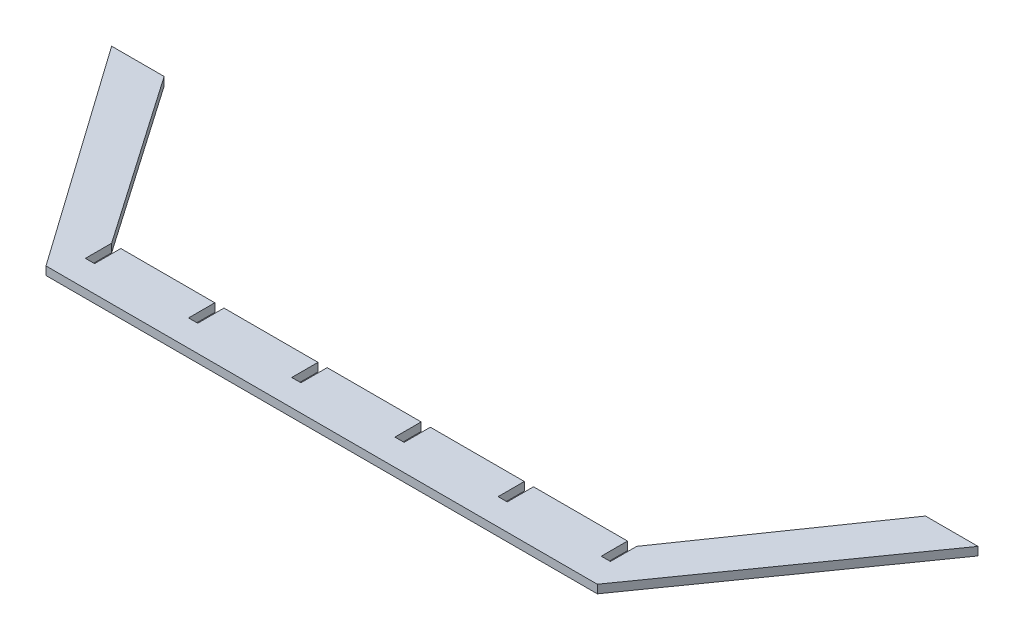
ISO-10303-21;
HEADER;
FILE_DESCRIPTION(('STEP AP214'),'2;1');
FILE_NAME('part.step','',(''),(''),'','','');
FILE_SCHEMA(('AUTOMOTIVE_DESIGN { 1 0 10303 214 1 1 1 1 }'));
ENDSEC;
DATA;
#1=APPLICATION_CONTEXT('core data for automotive mechanical design processes');
#2=APPLICATION_PROTOCOL_DEFINITION('international standard','automotive_design',2000,#1);
#3=PRODUCT_CONTEXT('',#1,'mechanical');
#4=PRODUCT('Part','Part','',(#3));
#5=PRODUCT_RELATED_PRODUCT_CATEGORY('part','',(#4));
#6=PRODUCT_DEFINITION_FORMATION('','',#4);
#7=PRODUCT_DEFINITION_CONTEXT('part definition',#1,'design');
#8=PRODUCT_DEFINITION('design','',#6,#7);
#9=PRODUCT_DEFINITION_SHAPE('','',#8);
#10=(LENGTH_UNIT() NAMED_UNIT(*) SI_UNIT(.MILLI.,.METRE.));
#11=(NAMED_UNIT(*) PLANE_ANGLE_UNIT() SI_UNIT($,.RADIAN.));
#12=(NAMED_UNIT(*) SI_UNIT($,.STERADIAN.) SOLID_ANGLE_UNIT());
#13=UNCERTAINTY_MEASURE_WITH_UNIT(LENGTH_MEASURE(1.E-05),#10,'distance_accuracy_value','');
#14=(GEOMETRIC_REPRESENTATION_CONTEXT(3) GLOBAL_UNCERTAINTY_ASSIGNED_CONTEXT((#13)) GLOBAL_UNIT_ASSIGNED_CONTEXT((#10,
#11,#12)) REPRESENTATION_CONTEXT('',''));
#15=CARTESIAN_POINT('',(0.,0.,0.));
#16=DIRECTION('',(0.,0.,1.));
#17=DIRECTION('',(1.,0.,0.));
#18=AXIS2_PLACEMENT_3D('',#15,#16,#17);
#19=CARTESIAN_POINT('',(0.,3.175,-20.));
#20=DIRECTION('',(0.,0.,1.));
#21=DIRECTION('',(1.,0.,0.));
#22=AXIS2_PLACEMENT_3D('',#19,#20,#21);
#23=PLANE('',#22);
#24=DIRECTION('',(-1.,0.,0.));
#25=VECTOR('',#24,1.);
#26=CARTESIAN_POINT('',(0.,0.,-20.));
#27=LINE('',#26,#25);
#28=CARTESIAN_POINT('',(78.6,0.,-20.));
#29=VERTEX_POINT('',#28);
#30=CARTESIAN_POINT('',(42.8,0.,-20.));
#31=VERTEX_POINT('',#30);
#32=EDGE_CURVE('E420',#29,#31,#27,.T.);
#33=ORIENTED_EDGE('',*,*,#32,.T.);
#34=DIRECTION('',(0.,1.,0.));
#35=VECTOR('',#34,1.);
#36=CARTESIAN_POINT('',(42.8,0.,-20.));
#37=LINE('',#36,#35);
#38=CARTESIAN_POINT('',(42.8,3.175,-20.));
#39=VERTEX_POINT('',#38);
#40=EDGE_CURVE('E257',#31,#39,#37,.T.);
#41=ORIENTED_EDGE('',*,*,#40,.T.);
#42=DIRECTION('',(-1.,0.,0.));
#43=VECTOR('',#42,1.);
#44=CARTESIAN_POINT('',(0.,3.175,-20.));
#45=LINE('',#44,#43);
#46=CARTESIAN_POINT('',(78.6,3.175,-20.));
#47=VERTEX_POINT('',#46);
#48=EDGE_CURVE('E401',#47,#39,#45,.T.);
#49=ORIENTED_EDGE('',*,*,#48,.F.);
#50=DIRECTION('',(0.,1.,0.));
#51=VECTOR('',#50,1.);
#52=CARTESIAN_POINT('',(78.6,0.,-20.));
#53=LINE('',#52,#51);
#54=EDGE_CURVE('E298',#29,#47,#53,.T.);
#55=ORIENTED_EDGE('',*,*,#54,.F.);
#56=EDGE_LOOP('',(#33,#41,#49,#55));
#57=FACE_BOUND('',#56,.T.);
#58=ADVANCED_FACE('F32',(#57),#23,.F.);
#59=CARTESIAN_POINT('',(117.9,0.,-20.));
#60=VERTEX_POINT('',#59);
#61=CARTESIAN_POINT('',(82.1,0.,-20.));
#62=VERTEX_POINT('',#61);
#63=EDGE_CURVE('E502',#60,#62,#27,.T.);
#64=ORIENTED_EDGE('',*,*,#63,.T.);
#65=DIRECTION('',(0.,1.,0.));
#66=VECTOR('',#65,1.);
#67=CARTESIAN_POINT('',(82.1,0.,-20.));
#68=LINE('',#67,#66);
#69=CARTESIAN_POINT('',(82.1,3.175,-20.));
#70=VERTEX_POINT('',#69);
#71=EDGE_CURVE('E277',#62,#70,#68,.T.);
#72=ORIENTED_EDGE('',*,*,#71,.T.);
#73=CARTESIAN_POINT('',(117.9,3.175,-20.));
#74=VERTEX_POINT('',#73);
#75=EDGE_CURVE('E528',#74,#70,#45,.T.);
#76=ORIENTED_EDGE('',*,*,#75,.F.);
#77=DIRECTION('',(0.,1.,0.));
#78=VECTOR('',#77,1.);
#79=CARTESIAN_POINT('',(117.9,0.,-20.));
#80=LINE('',#79,#78);
#81=EDGE_CURVE('E324',#60,#74,#80,.T.);
#82=ORIENTED_EDGE('',*,*,#81,.F.);
#83=EDGE_LOOP('',(#64,#72,#76,#82));
#84=FACE_BOUND('',#83,.T.);
#85=ADVANCED_FACE('F537',(#84),#23,.F.);
#86=CARTESIAN_POINT('',(157.2,0.,-20.));
#87=VERTEX_POINT('',#86);
#88=CARTESIAN_POINT('',(121.4,0.,-20.));
#89=VERTEX_POINT('',#88);
#90=EDGE_CURVE('E504',#87,#89,#27,.T.);
#91=ORIENTED_EDGE('',*,*,#90,.T.);
#92=DIRECTION('',(0.,1.,0.));
#93=VECTOR('',#92,1.);
#94=CARTESIAN_POINT('',(121.4,0.,-20.));
#95=LINE('',#94,#93);
#96=CARTESIAN_POINT('',(121.4,3.175,-20.));
#97=VERTEX_POINT('',#96);
#98=EDGE_CURVE('E303',#89,#97,#95,.T.);
#99=ORIENTED_EDGE('',*,*,#98,.T.);
#100=CARTESIAN_POINT('',(157.2,3.175,-20.));
#101=VERTEX_POINT('',#100);
#102=EDGE_CURVE('E526',#101,#97,#45,.T.);
#103=ORIENTED_EDGE('',*,*,#102,.F.);
#104=DIRECTION('',(0.,1.,0.));
#105=VECTOR('',#104,1.);
#106=CARTESIAN_POINT('',(157.2,0.,-20.));
#107=LINE('',#106,#105);
#108=EDGE_CURVE('E350',#87,#101,#107,.T.);
#109=ORIENTED_EDGE('',*,*,#108,.F.);
#110=EDGE_LOOP('',(#91,#99,#103,#109));
#111=FACE_BOUND('',#110,.T.);
#112=ADVANCED_FACE('F560',(#111),#23,.F.);
#113=CARTESIAN_POINT('',(196.5,0.,-20.));
#114=VERTEX_POINT('',#113);
#115=CARTESIAN_POINT('',(160.7,0.,-20.));
#116=VERTEX_POINT('',#115);
#117=EDGE_CURVE('E421',#114,#116,#27,.T.);
#118=ORIENTED_EDGE('',*,*,#117,.T.);
#119=DIRECTION('',(0.,1.,0.));
#120=VECTOR('',#119,1.);
#121=CARTESIAN_POINT('',(160.7,0.,-20.));
#122=LINE('',#121,#120);
#123=CARTESIAN_POINT('',(160.7,3.175,-20.));
#124=VERTEX_POINT('',#123);
#125=EDGE_CURVE('E329',#116,#124,#122,.T.);
#126=ORIENTED_EDGE('',*,*,#125,.T.);
#127=CARTESIAN_POINT('',(196.5,3.175,-20.));
#128=VERTEX_POINT('',#127);
#129=EDGE_CURVE('E402',#128,#124,#45,.T.);
#130=ORIENTED_EDGE('',*,*,#129,.F.);
#131=DIRECTION('',(0.,1.,0.));
#132=VECTOR('',#131,1.);
#133=CARTESIAN_POINT('',(196.5,0.,-20.));
#134=LINE('',#133,#132);
#135=EDGE_CURVE('E376',#114,#128,#134,.T.);
#136=ORIENTED_EDGE('',*,*,#135,.F.);
#137=EDGE_LOOP('',(#118,#126,#130,#136));
#138=FACE_BOUND('',#137,.T.);
#139=ADVANCED_FACE('F516',(#138),#23,.F.);
#140=CARTESIAN_POINT('',(205.,3.175,0.));
#141=DIRECTION('',(-0.816967863264762,0.,-0.576683197598655));
#142=DIRECTION('',(-0.576683197598655,0.,0.816967863264762));
#143=AXIS2_PLACEMENT_3D('',#140,#141,#142);
#144=PLANE('',#143);
#145=DIRECTION('',(0.576683197598655,0.,-0.816967863264762));
#146=VECTOR('',#145,1.);
#147=CARTESIAN_POINT('',(205.,0.,0.));
#148=LINE('',#147,#146);
#149=CARTESIAN_POINT('',(205.,0.,0.));
#150=VERTEX_POINT('',#149);
#151=CARTESIAN_POINT('',(265.,0.,-85.));
#152=VERTEX_POINT('',#151);
#153=EDGE_CURVE('E262',#150,#152,#148,.T.);
#154=ORIENTED_EDGE('',*,*,#153,.T.);
#155=DIRECTION('',(0.,-1.,0.));
#156=VECTOR('',#155,1.);
#157=CARTESIAN_POINT('',(265.,3.175,-85.));
#158=LINE('',#157,#156);
#159=CARTESIAN_POINT('',(265.,3.175,-85.));
#160=VERTEX_POINT('',#159);
#161=EDGE_CURVE('E40',#160,#152,#158,.T.);
#162=ORIENTED_EDGE('',*,*,#161,.F.);
#163=DIRECTION('',(0.576683197598655,0.,-0.816967863264762));
#164=VECTOR('',#163,1.);
#165=CARTESIAN_POINT('',(205.,3.175,0.));
#166=LINE('',#165,#164);
#167=CARTESIAN_POINT('',(205.,3.175,0.));
#168=VERTEX_POINT('',#167);
#169=EDGE_CURVE('E390',#168,#160,#166,.T.);
#170=ORIENTED_EDGE('',*,*,#169,.F.);
#171=DIRECTION('',(0.,-1.,0.));
#172=VECTOR('',#171,1.);
#173=CARTESIAN_POINT('',(205.,3.175,0.));
#174=LINE('',#173,#172);
#175=EDGE_CURVE('E11',#168,#150,#174,.T.);
#176=ORIENTED_EDGE('',*,*,#175,.T.);
#177=EDGE_LOOP('',(#154,#162,#170,#176));
#178=FACE_BOUND('',#177,.T.);
#179=ADVANCED_FACE('F34',(#178),#144,.F.);
#180=CARTESIAN_POINT('',(245.,3.175,-85.));
#181=DIRECTION('',(0.,0.,1.));
#182=DIRECTION('',(1.,0.,0.));
#183=AXIS2_PLACEMENT_3D('',#180,#181,#182);
#184=PLANE('',#183);
#185=DIRECTION('',(-1.,0.,0.));
#186=VECTOR('',#185,1.);
#187=CARTESIAN_POINT('',(245.,0.,-85.));
#188=LINE('',#187,#186);
#189=CARTESIAN_POINT('',(245.,0.,-85.));
#190=VERTEX_POINT('',#189);
#191=EDGE_CURVE('E412',#152,#190,#188,.T.);
#192=ORIENTED_EDGE('',*,*,#191,.T.);
#193=DIRECTION('',(0.,-1.,0.));
#194=VECTOR('',#193,1.);
#195=CARTESIAN_POINT('',(245.,3.175,-85.));
#196=LINE('',#195,#194);
#197=CARTESIAN_POINT('',(245.,3.175,-85.));
#198=VERTEX_POINT('',#197);
#199=EDGE_CURVE('E440',#198,#190,#196,.T.);
#200=ORIENTED_EDGE('',*,*,#199,.F.);
#201=DIRECTION('',(-1.,0.,0.));
#202=VECTOR('',#201,1.);
#203=CARTESIAN_POINT('',(245.,3.175,-85.));
#204=LINE('',#203,#202);
#205=EDGE_CURVE('E393',#160,#198,#204,.T.);
#206=ORIENTED_EDGE('',*,*,#205,.F.);
#207=ORIENTED_EDGE('',*,*,#161,.T.);
#208=EDGE_LOOP('',(#192,#200,#206,#207));
#209=FACE_BOUND('',#208,.T.);
#210=ADVANCED_FACE('F447',(#209),#184,.F.);
#211=CARTESIAN_POINT('',(200.,3.175,-20.));
#212=DIRECTION('',(0.822192191643778,0.,0.569209978830308));
#213=DIRECTION('',(0.569209978830309,0.,-0.822192191643779));
#214=AXIS2_PLACEMENT_3D('',#211,#212,#213);
#215=PLANE('',#214);
#216=DIRECTION('',(-0.569209978830308,0.,0.822192191643778));
#217=VECTOR('',#216,1.);
#218=CARTESIAN_POINT('',(200.,0.,-20.));
#219=LINE('',#218,#217);
#220=CARTESIAN_POINT('',(200.,0.,-20.));
#221=VERTEX_POINT('',#220);
#222=EDGE_CURVE('E414',#190,#221,#219,.T.);
#223=ORIENTED_EDGE('',*,*,#222,.T.);
#224=DIRECTION('',(0.,-1.,0.));
#225=VECTOR('',#224,1.);
#226=CARTESIAN_POINT('',(200.,3.175,-20.));
#227=LINE('',#226,#225);
#228=CARTESIAN_POINT('',(200.,3.175,-20.));
#229=VERTEX_POINT('',#228);
#230=EDGE_CURVE('E438',#229,#221,#227,.T.);
#231=ORIENTED_EDGE('',*,*,#230,.F.);
#232=DIRECTION('',(-0.569209978830308,0.,0.822192191643778));
#233=VECTOR('',#232,1.);
#234=CARTESIAN_POINT('',(200.,3.175,-20.));
#235=LINE('',#234,#233);
#236=EDGE_CURVE('E395',#198,#229,#235,.T.);
#237=ORIENTED_EDGE('',*,*,#236,.F.);
#238=ORIENTED_EDGE('',*,*,#199,.T.);
#239=EDGE_LOOP('',(#223,#231,#237,#238));
#240=FACE_BOUND('',#239,.T.);
#241=ADVANCED_FACE('F457',(#240),#215,.F.);
#242=CARTESIAN_POINT('',(39.3,0.,-20.));
#243=VERTEX_POINT('',#242);
#244=CARTESIAN_POINT('',(3.5,0.,-20.));
#245=VERTEX_POINT('',#244);
#246=EDGE_CURVE('E417',#243,#245,#27,.T.);
#247=ORIENTED_EDGE('',*,*,#246,.T.);
#248=DIRECTION('',(0.,1.,0.));
#249=VECTOR('',#248,1.);
#250=CARTESIAN_POINT('',(3.5,0.,-20.));
#251=LINE('',#250,#249);
#252=CARTESIAN_POINT('',(3.5,3.175,-20.));
#253=VERTEX_POINT('',#252);
#254=EDGE_CURVE('E259',#245,#253,#251,.T.);
#255=ORIENTED_EDGE('',*,*,#254,.T.);
#256=CARTESIAN_POINT('',(39.3,3.175,-20.));
#257=VERTEX_POINT('',#256);
#258=EDGE_CURVE('E398',#257,#253,#45,.T.);
#259=ORIENTED_EDGE('',*,*,#258,.F.);
#260=DIRECTION('',(0.,1.,0.));
#261=VECTOR('',#260,1.);
#262=CARTESIAN_POINT('',(39.3,0.,-20.));
#263=LINE('',#262,#261);
#264=EDGE_CURVE('E272',#243,#257,#263,.T.);
#265=ORIENTED_EDGE('',*,*,#264,.F.);
#266=EDGE_LOOP('',(#247,#255,#259,#265));
#267=FACE_BOUND('',#266,.T.);
#268=ADVANCED_FACE('F484',(#267),#23,.F.);
#269=CARTESIAN_POINT('',(-45.,3.175,-85.));
#270=DIRECTION('',(-0.822192191643779,0.,0.569209978830308));
#271=DIRECTION('',(0.569209978830308,0.,0.822192191643779));
#272=AXIS2_PLACEMENT_3D('',#269,#270,#271);
#273=PLANE('',#272);
#274=DIRECTION('',(-0.569209978830308,0.,-0.822192191643779));
#275=VECTOR('',#274,1.);
#276=CARTESIAN_POINT('',(-45.,0.,-85.));
#277=LINE('',#276,#275);
#278=CARTESIAN_POINT('',(0.,0.,-20.));
#279=VERTEX_POINT('',#278);
#280=CARTESIAN_POINT('',(-45.,0.,-85.));
#281=VERTEX_POINT('',#280);
#282=EDGE_CURVE('E249',#279,#281,#277,.T.);
#283=ORIENTED_EDGE('',*,*,#282,.T.);
#284=DIRECTION('',(0.,-1.,0.));
#285=VECTOR('',#284,1.);
#286=CARTESIAN_POINT('',(-45.,3.175,-85.));
#287=LINE('',#286,#285);
#288=CARTESIAN_POINT('',(-45.,3.175,-85.));
#289=VERTEX_POINT('',#288);
#290=EDGE_CURVE('E433',#289,#281,#287,.T.);
#291=ORIENTED_EDGE('',*,*,#290,.F.);
#292=DIRECTION('',(-0.569209978830308,0.,-0.822192191643779));
#293=VECTOR('',#292,1.);
#294=CARTESIAN_POINT('',(-45.,3.175,-85.));
#295=LINE('',#294,#293);
#296=CARTESIAN_POINT('',(0.,3.175,-20.));
#297=VERTEX_POINT('',#296);
#298=EDGE_CURVE('E403',#297,#289,#295,.T.);
#299=ORIENTED_EDGE('',*,*,#298,.F.);
#300=DIRECTION('',(0.,-1.,0.));
#301=VECTOR('',#300,1.);
#302=CARTESIAN_POINT('',(0.,3.175,-20.));
#303=LINE('',#302,#301);
#304=EDGE_CURVE('E436',#297,#279,#303,.T.);
#305=ORIENTED_EDGE('',*,*,#304,.T.);
#306=EDGE_LOOP('',(#283,#291,#299,#305));
#307=FACE_BOUND('',#306,.T.);
#308=ADVANCED_FACE('F478',(#307),#273,.F.);
#309=CARTESIAN_POINT('',(-65.,3.175,-85.));
#310=DIRECTION('',(0.,0.,1.));
#311=DIRECTION('',(1.,0.,0.));
#312=AXIS2_PLACEMENT_3D('',#309,#310,#311);
#313=PLANE('',#312);
#314=DIRECTION('',(-1.,0.,0.));
#315=VECTOR('',#314,1.);
#316=CARTESIAN_POINT('',(-65.,0.,-85.));
#317=LINE('',#316,#315);
#318=CARTESIAN_POINT('',(-65.,0.,-85.));
#319=VERTEX_POINT('',#318);
#320=EDGE_CURVE('E423',#281,#319,#317,.T.);
#321=ORIENTED_EDGE('',*,*,#320,.T.);
#322=DIRECTION('',(0.,-1.,0.));
#323=VECTOR('',#322,1.);
#324=CARTESIAN_POINT('',(-65.,3.175,-85.));
#325=LINE('',#324,#323);
#326=CARTESIAN_POINT('',(-65.,3.175,-85.));
#327=VERTEX_POINT('',#326);
#328=EDGE_CURVE('E430',#327,#319,#325,.T.);
#329=ORIENTED_EDGE('',*,*,#328,.F.);
#330=DIRECTION('',(-1.,0.,0.));
#331=VECTOR('',#330,1.);
#332=CARTESIAN_POINT('',(-65.,3.175,-85.));
#333=LINE('',#332,#331);
#334=EDGE_CURVE('E405',#289,#327,#333,.T.);
#335=ORIENTED_EDGE('',*,*,#334,.F.);
#336=ORIENTED_EDGE('',*,*,#290,.T.);
#337=EDGE_LOOP('',(#321,#329,#335,#336));
#338=FACE_BOUND('',#337,.T.);
#339=ADVANCED_FACE('F474',(#338),#313,.F.);
#340=CARTESIAN_POINT('',(-5.,3.175,0.));
#341=DIRECTION('',(0.816967863264762,0.,-0.576683197598655));
#342=DIRECTION('',(-0.576683197598655,0.,-0.816967863264762));
#343=AXIS2_PLACEMENT_3D('',#340,#341,#342);
#344=PLANE('',#343);
#345=DIRECTION('',(0.576683197598655,0.,0.816967863264762));
#346=VECTOR('',#345,1.);
#347=CARTESIAN_POINT('',(-5.,0.,0.));
#348=LINE('',#347,#346);
#349=CARTESIAN_POINT('',(-5.,0.,0.));
#350=VERTEX_POINT('',#349);
#351=EDGE_CURVE('E425',#319,#350,#348,.T.);
#352=ORIENTED_EDGE('',*,*,#351,.T.);
#353=DIRECTION('',(0.,-1.,0.));
#354=VECTOR('',#353,1.);
#355=CARTESIAN_POINT('',(-5.,3.175,0.));
#356=LINE('',#355,#354);
#357=CARTESIAN_POINT('',(-5.,3.175,0.));
#358=VERTEX_POINT('',#357);
#359=EDGE_CURVE('E410',#358,#350,#356,.T.);
#360=ORIENTED_EDGE('',*,*,#359,.F.);
#361=DIRECTION('',(0.576683197598655,0.,0.816967863264762));
#362=VECTOR('',#361,1.);
#363=CARTESIAN_POINT('',(-5.,3.175,0.));
#364=LINE('',#363,#362);
#365=EDGE_CURVE('E407',#327,#358,#364,.T.);
#366=ORIENTED_EDGE('',*,*,#365,.F.);
#367=ORIENTED_EDGE('',*,*,#328,.T.);
#368=EDGE_LOOP('',(#352,#360,#366,#367));
#369=FACE_BOUND('',#368,.T.);
#370=ADVANCED_FACE('F469',(#369),#344,.F.);
#371=CARTESIAN_POINT('',(0.,3.175,0.));
#372=DIRECTION('',(0.,0.,-1.));
#373=DIRECTION('',(-1.,0.,0.));
#374=AXIS2_PLACEMENT_3D('',#371,#372,#373);
#375=PLANE('',#374);
#376=DIRECTION('',(1.,0.,0.));
#377=VECTOR('',#376,1.);
#378=CARTESIAN_POINT('',(0.,0.,0.));
#379=LINE('',#378,#377);
#380=EDGE_CURVE('E391',#350,#150,#379,.T.);
#381=ORIENTED_EDGE('',*,*,#380,.T.);
#382=ORIENTED_EDGE('',*,*,#175,.F.);
#383=DIRECTION('',(1.,0.,0.));
#384=VECTOR('',#383,1.);
#385=CARTESIAN_POINT('',(0.,3.175,0.));
#386=LINE('',#385,#384);
#387=EDGE_CURVE('E388',#358,#168,#386,.T.);
#388=ORIENTED_EDGE('',*,*,#387,.F.);
#389=ORIENTED_EDGE('',*,*,#359,.T.);
#390=EDGE_LOOP('',(#381,#382,#388,#389));
#391=FACE_BOUND('',#390,.T.);
#392=ADVANCED_FACE('F465',(#391),#375,.F.);
#393=CARTESIAN_POINT('',(0.,3.175,0.));
#394=DIRECTION('',(0.,1.,0.));
#395=DIRECTION('',(0.,0.,1.));
#396=AXIS2_PLACEMENT_3D('',#393,#394,#395);
#397=PLANE('',#396);
#398=DIRECTION('',(0.,0.,1.));
#399=VECTOR('',#398,1.);
#400=CARTESIAN_POINT('',(0.,3.175,-20.));
#401=LINE('',#400,#399);
#402=CARTESIAN_POINT('',(0.,3.175,-10.));
#403=VERTEX_POINT('',#402);
#404=EDGE_CURVE('E235',#297,#403,#401,.T.);
#405=ORIENTED_EDGE('',*,*,#404,.F.);
#406=ORIENTED_EDGE('',*,*,#298,.T.);
#407=ORIENTED_EDGE('',*,*,#334,.T.);
#408=ORIENTED_EDGE('',*,*,#365,.T.);
#409=ORIENTED_EDGE('',*,*,#387,.T.);
#410=ORIENTED_EDGE('',*,*,#169,.T.);
#411=ORIENTED_EDGE('',*,*,#205,.T.);
#412=ORIENTED_EDGE('',*,*,#236,.T.);
#413=DIRECTION('',(0.,0.,-1.));
#414=VECTOR('',#413,1.);
#415=CARTESIAN_POINT('',(200.,3.175,-20.));
#416=LINE('',#415,#414);
#417=CARTESIAN_POINT('',(200.,3.175,-10.));
#418=VERTEX_POINT('',#417);
#419=EDGE_CURVE('E370',#418,#229,#416,.T.);
#420=ORIENTED_EDGE('',*,*,#419,.F.);
#421=DIRECTION('',(1.,0.,0.));
#422=VECTOR('',#421,1.);
#423=CARTESIAN_POINT('',(196.5,3.175,-10.));
#424=LINE('',#423,#422);
#425=CARTESIAN_POINT('',(196.5,3.175,-10.));
#426=VERTEX_POINT('',#425);
#427=EDGE_CURVE('E380',#426,#418,#424,.T.);
#428=ORIENTED_EDGE('',*,*,#427,.F.);
#429=DIRECTION('',(0.,0.,1.));
#430=VECTOR('',#429,1.);
#431=CARTESIAN_POINT('',(196.5,3.175,-20.));
#432=LINE('',#431,#430);
#433=EDGE_CURVE('E377',#128,#426,#432,.T.);
#434=ORIENTED_EDGE('',*,*,#433,.F.);
#435=ORIENTED_EDGE('',*,*,#129,.T.);
#436=DIRECTION('',(0.,0.,-1.));
#437=VECTOR('',#436,1.);
#438=CARTESIAN_POINT('',(160.7,3.175,-20.));
#439=LINE('',#438,#437);
#440=CARTESIAN_POINT('',(160.7,3.175,-10.));
#441=VERTEX_POINT('',#440);
#442=EDGE_CURVE('E344',#441,#124,#439,.T.);
#443=ORIENTED_EDGE('',*,*,#442,.F.);
#444=DIRECTION('',(1.,0.,0.));
#445=VECTOR('',#444,1.);
#446=CARTESIAN_POINT('',(157.2,3.175,-10.));
#447=LINE('',#446,#445);
#448=CARTESIAN_POINT('',(157.2,3.175,-10.));
#449=VERTEX_POINT('',#448);
#450=EDGE_CURVE('E354',#449,#441,#447,.T.);
#451=ORIENTED_EDGE('',*,*,#450,.F.);
#452=DIRECTION('',(0.,0.,1.));
#453=VECTOR('',#452,1.);
#454=CARTESIAN_POINT('',(157.2,3.175,-20.));
#455=LINE('',#454,#453);
#456=EDGE_CURVE('E351',#101,#449,#455,.T.);
#457=ORIENTED_EDGE('',*,*,#456,.F.);
#458=ORIENTED_EDGE('',*,*,#102,.T.);
#459=DIRECTION('',(0.,0.,-1.));
#460=VECTOR('',#459,1.);
#461=CARTESIAN_POINT('',(121.4,3.175,-20.));
#462=LINE('',#461,#460);
#463=CARTESIAN_POINT('',(121.4,3.175,-10.));
#464=VERTEX_POINT('',#463);
#465=EDGE_CURVE('E318',#464,#97,#462,.T.);
#466=ORIENTED_EDGE('',*,*,#465,.F.);
#467=DIRECTION('',(1.,0.,0.));
#468=VECTOR('',#467,1.);
#469=CARTESIAN_POINT('',(117.9,3.175,-10.));
#470=LINE('',#469,#468);
#471=CARTESIAN_POINT('',(117.9,3.175,-10.));
#472=VERTEX_POINT('',#471);
#473=EDGE_CURVE('E328',#472,#464,#470,.T.);
#474=ORIENTED_EDGE('',*,*,#473,.F.);
#475=DIRECTION('',(0.,0.,1.));
#476=VECTOR('',#475,1.);
#477=CARTESIAN_POINT('',(117.9,3.175,-20.));
#478=LINE('',#477,#476);
#479=EDGE_CURVE('E325',#74,#472,#478,.T.);
#480=ORIENTED_EDGE('',*,*,#479,.F.);
#481=ORIENTED_EDGE('',*,*,#75,.T.);
#482=DIRECTION('',(0.,0.,-1.));
#483=VECTOR('',#482,1.);
#484=CARTESIAN_POINT('',(82.1,3.175,-20.));
#485=LINE('',#484,#483);
#486=CARTESIAN_POINT('',(82.1,3.175,-10.));
#487=VERTEX_POINT('',#486);
#488=EDGE_CURVE('E292',#487,#70,#485,.T.);
#489=ORIENTED_EDGE('',*,*,#488,.F.);
#490=DIRECTION('',(1.,0.,0.));
#491=VECTOR('',#490,1.);
#492=CARTESIAN_POINT('',(78.6,3.175,-10.));
#493=LINE('',#492,#491);
#494=CARTESIAN_POINT('',(78.6,3.175,-10.));
#495=VERTEX_POINT('',#494);
#496=EDGE_CURVE('E302',#495,#487,#493,.T.);
#497=ORIENTED_EDGE('',*,*,#496,.F.);
#498=DIRECTION('',(0.,0.,1.));
#499=VECTOR('',#498,1.);
#500=CARTESIAN_POINT('',(78.6,3.175,-20.));
#501=LINE('',#500,#499);
#502=EDGE_CURVE('E299',#47,#495,#501,.T.);
#503=ORIENTED_EDGE('',*,*,#502,.F.);
#504=ORIENTED_EDGE('',*,*,#48,.T.);
#505=DIRECTION('',(0.,0.,-1.));
#506=VECTOR('',#505,1.);
#507=CARTESIAN_POINT('',(42.8,3.175,-20.));
#508=LINE('',#507,#506);
#509=CARTESIAN_POINT('',(42.8,3.175,-10.));
#510=VERTEX_POINT('',#509);
#511=EDGE_CURVE('E267',#510,#39,#508,.T.);
#512=ORIENTED_EDGE('',*,*,#511,.F.);
#513=DIRECTION('',(1.,0.,0.));
#514=VECTOR('',#513,1.);
#515=CARTESIAN_POINT('',(39.3,3.175,-10.));
#516=LINE('',#515,#514);
#517=CARTESIAN_POINT('',(39.3,3.175,-10.));
#518=VERTEX_POINT('',#517);
#519=EDGE_CURVE('E276',#518,#510,#516,.T.);
#520=ORIENTED_EDGE('',*,*,#519,.F.);
#521=DIRECTION('',(0.,0.,1.));
#522=VECTOR('',#521,1.);
#523=CARTESIAN_POINT('',(39.3,3.175,-20.));
#524=LINE('',#523,#522);
#525=EDGE_CURVE('E273',#257,#518,#524,.T.);
#526=ORIENTED_EDGE('',*,*,#525,.F.);
#527=ORIENTED_EDGE('',*,*,#258,.T.);
#528=DIRECTION('',(0.,0.,-1.));
#529=VECTOR('',#528,1.);
#530=CARTESIAN_POINT('',(3.5,3.175,-20.));
#531=LINE('',#530,#529);
#532=CARTESIAN_POINT('',(3.5,3.175,-10.));
#533=VERTEX_POINT('',#532);
#534=EDGE_CURVE('E250',#533,#253,#531,.T.);
#535=ORIENTED_EDGE('',*,*,#534,.F.);
#536=DIRECTION('',(1.,0.,0.));
#537=VECTOR('',#536,1.);
#538=CARTESIAN_POINT('',(0.,3.175,-10.));
#539=LINE('',#538,#537);
#540=EDGE_CURVE('E252',#403,#533,#539,.T.);
#541=ORIENTED_EDGE('',*,*,#540,.F.);
#542=EDGE_LOOP('',(#405,#406,#407,#408,#409,#410,#411,#412,#420,#428,#434,#435,#443,#451,#457,
#458,#466,#474,#480,#481,#489,#497,#503,#504,#512,#520,#526,#527,#535,#541));
#543=FACE_BOUND('',#542,.T.);
#544=ADVANCED_FACE('F461',(#543),#397,.T.);
#545=CARTESIAN_POINT('',(0.,0.,0.));
#546=DIRECTION('',(0.,1.,0.));
#547=DIRECTION('',(0.,0.,1.));
#548=AXIS2_PLACEMENT_3D('',#545,#546,#547);
#549=PLANE('',#548);
#550=ORIENTED_EDGE('',*,*,#282,.F.);
#551=DIRECTION('',(0.,0.,1.));
#552=VECTOR('',#551,1.);
#553=CARTESIAN_POINT('',(0.,0.,-20.));
#554=LINE('',#553,#552);
#555=CARTESIAN_POINT('',(0.,0.,-10.));
#556=VERTEX_POINT('',#555);
#557=EDGE_CURVE('E232',#279,#556,#554,.T.);
#558=ORIENTED_EDGE('',*,*,#557,.T.);
#559=DIRECTION('',(1.,0.,0.));
#560=VECTOR('',#559,1.);
#561=CARTESIAN_POINT('',(0.,0.,-10.));
#562=LINE('',#561,#560);
#563=CARTESIAN_POINT('',(3.5,0.,-10.));
#564=VERTEX_POINT('',#563);
#565=EDGE_CURVE('E242',#556,#564,#562,.T.);
#566=ORIENTED_EDGE('',*,*,#565,.T.);
#567=DIRECTION('',(0.,0.,-1.));
#568=VECTOR('',#567,1.);
#569=CARTESIAN_POINT('',(3.5,0.,-20.));
#570=LINE('',#569,#568);
#571=EDGE_CURVE('E47',#564,#245,#570,.T.);
#572=ORIENTED_EDGE('',*,*,#571,.T.);
#573=ORIENTED_EDGE('',*,*,#246,.F.);
#574=DIRECTION('',(0.,0.,1.));
#575=VECTOR('',#574,1.);
#576=CARTESIAN_POINT('',(39.3,0.,-20.));
#577=LINE('',#576,#575);
#578=CARTESIAN_POINT('',(39.3,0.,-10.));
#579=VERTEX_POINT('',#578);
#580=EDGE_CURVE('E264',#243,#579,#577,.T.);
#581=ORIENTED_EDGE('',*,*,#580,.T.);
#582=DIRECTION('',(1.,0.,0.));
#583=VECTOR('',#582,1.);
#584=CARTESIAN_POINT('',(39.3,0.,-10.));
#585=LINE('',#584,#583);
#586=CARTESIAN_POINT('',(42.8,0.,-10.));
#587=VERTEX_POINT('',#586);
#588=EDGE_CURVE('E55',#579,#587,#585,.T.);
#589=ORIENTED_EDGE('',*,*,#588,.T.);
#590=DIRECTION('',(0.,0.,-1.));
#591=VECTOR('',#590,1.);
#592=CARTESIAN_POINT('',(42.8,0.,-20.));
#593=LINE('',#592,#591);
#594=EDGE_CURVE('E269',#587,#31,#593,.T.);
#595=ORIENTED_EDGE('',*,*,#594,.T.);
#596=ORIENTED_EDGE('',*,*,#32,.F.);
#597=DIRECTION('',(0.,0.,1.));
#598=VECTOR('',#597,1.);
#599=CARTESIAN_POINT('',(78.6,0.,-20.));
#600=LINE('',#599,#598);
#601=CARTESIAN_POINT('',(78.6,0.,-10.));
#602=VERTEX_POINT('',#601);
#603=EDGE_CURVE('E288',#29,#602,#600,.T.);
#604=ORIENTED_EDGE('',*,*,#603,.T.);
#605=DIRECTION('',(1.,0.,0.));
#606=VECTOR('',#605,1.);
#607=CARTESIAN_POINT('',(78.6,0.,-10.));
#608=LINE('',#607,#606);
#609=CARTESIAN_POINT('',(82.1,0.,-10.));
#610=VERTEX_POINT('',#609);
#611=EDGE_CURVE('E291',#602,#610,#608,.T.);
#612=ORIENTED_EDGE('',*,*,#611,.T.);
#613=DIRECTION('',(0.,0.,-1.));
#614=VECTOR('',#613,1.);
#615=CARTESIAN_POINT('',(82.1,0.,-20.));
#616=LINE('',#615,#614);
#617=EDGE_CURVE('E295',#610,#62,#616,.T.);
#618=ORIENTED_EDGE('',*,*,#617,.T.);
#619=ORIENTED_EDGE('',*,*,#63,.F.);
#620=DIRECTION('',(0.,0.,1.));
#621=VECTOR('',#620,1.);
#622=CARTESIAN_POINT('',(117.9,0.,-20.));
#623=LINE('',#622,#621);
#624=CARTESIAN_POINT('',(117.9,0.,-10.));
#625=VERTEX_POINT('',#624);
#626=EDGE_CURVE('E314',#60,#625,#623,.T.);
#627=ORIENTED_EDGE('',*,*,#626,.T.);
#628=DIRECTION('',(1.,0.,0.));
#629=VECTOR('',#628,1.);
#630=CARTESIAN_POINT('',(117.9,0.,-10.));
#631=LINE('',#630,#629);
#632=CARTESIAN_POINT('',(121.4,0.,-10.));
#633=VERTEX_POINT('',#632);
#634=EDGE_CURVE('E317',#625,#633,#631,.T.);
#635=ORIENTED_EDGE('',*,*,#634,.T.);
#636=DIRECTION('',(0.,0.,-1.));
#637=VECTOR('',#636,1.);
#638=CARTESIAN_POINT('',(121.4,0.,-20.));
#639=LINE('',#638,#637);
#640=EDGE_CURVE('E321',#633,#89,#639,.T.);
#641=ORIENTED_EDGE('',*,*,#640,.T.);
#642=ORIENTED_EDGE('',*,*,#90,.F.);
#643=DIRECTION('',(0.,0.,1.));
#644=VECTOR('',#643,1.);
#645=CARTESIAN_POINT('',(157.2,0.,-20.));
#646=LINE('',#645,#644);
#647=CARTESIAN_POINT('',(157.2,0.,-10.));
#648=VERTEX_POINT('',#647);
#649=EDGE_CURVE('E340',#87,#648,#646,.T.);
#650=ORIENTED_EDGE('',*,*,#649,.T.);
#651=DIRECTION('',(1.,0.,0.));
#652=VECTOR('',#651,1.);
#653=CARTESIAN_POINT('',(157.2,0.,-10.));
#654=LINE('',#653,#652);
#655=CARTESIAN_POINT('',(160.7,0.,-10.));
#656=VERTEX_POINT('',#655);
#657=EDGE_CURVE('E343',#648,#656,#654,.T.);
#658=ORIENTED_EDGE('',*,*,#657,.T.);
#659=DIRECTION('',(0.,0.,-1.));
#660=VECTOR('',#659,1.);
#661=CARTESIAN_POINT('',(160.7,0.,-20.));
#662=LINE('',#661,#660);
#663=EDGE_CURVE('E347',#656,#116,#662,.T.);
#664=ORIENTED_EDGE('',*,*,#663,.T.);
#665=ORIENTED_EDGE('',*,*,#117,.F.);
#666=DIRECTION('',(0.,0.,1.));
#667=VECTOR('',#666,1.);
#668=CARTESIAN_POINT('',(196.5,0.,-20.));
#669=LINE('',#668,#667);
#670=CARTESIAN_POINT('',(196.5,0.,-10.));
#671=VERTEX_POINT('',#670);
#672=EDGE_CURVE('E366',#114,#671,#669,.T.);
#673=ORIENTED_EDGE('',*,*,#672,.T.);
#674=DIRECTION('',(1.,0.,0.));
#675=VECTOR('',#674,1.);
#676=CARTESIAN_POINT('',(196.5,0.,-10.));
#677=LINE('',#676,#675);
#678=CARTESIAN_POINT('',(200.,0.,-10.));
#679=VERTEX_POINT('',#678);
#680=EDGE_CURVE('E369',#671,#679,#677,.T.);
#681=ORIENTED_EDGE('',*,*,#680,.T.);
#682=DIRECTION('',(0.,0.,-1.));
#683=VECTOR('',#682,1.);
#684=CARTESIAN_POINT('',(200.,0.,-20.));
#685=LINE('',#684,#683);
#686=EDGE_CURVE('E373',#679,#221,#685,.T.);
#687=ORIENTED_EDGE('',*,*,#686,.T.);
#688=ORIENTED_EDGE('',*,*,#222,.F.);
#689=ORIENTED_EDGE('',*,*,#191,.F.);
#690=ORIENTED_EDGE('',*,*,#153,.F.);
#691=ORIENTED_EDGE('',*,*,#380,.F.);
#692=ORIENTED_EDGE('',*,*,#351,.F.);
#693=ORIENTED_EDGE('',*,*,#320,.F.);
#694=EDGE_LOOP('',(#550,#558,#566,#572,#573,#581,#589,#595,#596,#604,#612,#618,#619,#627,#635,
#641,#642,#650,#658,#664,#665,#673,#681,#687,#688,#689,#690,#691,#692,#693));
#695=FACE_BOUND('',#694,.T.);
#696=ADVANCED_FACE('F247',(#695),#549,.F.);
#697=CARTESIAN_POINT('',(200.,0.,-20.));
#698=DIRECTION('',(1.,0.,0.));
#699=DIRECTION('',(0.,0.,-1.));
#700=AXIS2_PLACEMENT_3D('',#697,#698,#699);
#701=PLANE('',#700);
#702=ORIENTED_EDGE('',*,*,#419,.T.);
#703=ORIENTED_EDGE('',*,*,#230,.T.);
#704=ORIENTED_EDGE('',*,*,#686,.F.);
#705=DIRECTION('',(0.,1.,0.));
#706=VECTOR('',#705,1.);
#707=CARTESIAN_POINT('',(200.,0.,-10.));
#708=LINE('',#707,#706);
#709=EDGE_CURVE('E355',#679,#418,#708,.T.);
#710=ORIENTED_EDGE('',*,*,#709,.T.);
#711=EDGE_LOOP('',(#702,#703,#704,#710));
#712=FACE_BOUND('',#711,.T.);
#713=ADVANCED_FACE('F658',(#712),#701,.F.);
#714=CARTESIAN_POINT('',(196.5,0.,-10.));
#715=DIRECTION('',(0.,0.,1.));
#716=DIRECTION('',(1.,0.,0.));
#717=AXIS2_PLACEMENT_3D('',#714,#715,#716);
#718=PLANE('',#717);
#719=ORIENTED_EDGE('',*,*,#427,.T.);
#720=ORIENTED_EDGE('',*,*,#709,.F.);
#721=ORIENTED_EDGE('',*,*,#680,.F.);
#722=DIRECTION('',(0.,1.,0.));
#723=VECTOR('',#722,1.);
#724=CARTESIAN_POINT('',(196.5,0.,-10.));
#725=LINE('',#724,#723);
#726=EDGE_CURVE('E385',#671,#426,#725,.T.);
#727=ORIENTED_EDGE('',*,*,#726,.T.);
#728=EDGE_LOOP('',(#719,#720,#721,#727));
#729=FACE_BOUND('',#728,.T.);
#730=ADVANCED_FACE('F666',(#729),#718,.F.);
#731=CARTESIAN_POINT('',(196.5,0.,-20.));
#732=DIRECTION('',(-1.,0.,0.));
#733=DIRECTION('',(0.,0.,1.));
#734=AXIS2_PLACEMENT_3D('',#731,#732,#733);
#735=PLANE('',#734);
#736=ORIENTED_EDGE('',*,*,#433,.T.);
#737=ORIENTED_EDGE('',*,*,#726,.F.);
#738=ORIENTED_EDGE('',*,*,#672,.F.);
#739=ORIENTED_EDGE('',*,*,#135,.T.);
#740=EDGE_LOOP('',(#736,#737,#738,#739));
#741=FACE_BOUND('',#740,.T.);
#742=ADVANCED_FACE('F676',(#741),#735,.F.);
#743=CARTESIAN_POINT('',(160.7,0.,-20.));
#744=DIRECTION('',(1.,0.,0.));
#745=DIRECTION('',(0.,0.,-1.));
#746=AXIS2_PLACEMENT_3D('',#743,#744,#745);
#747=PLANE('',#746);
#748=ORIENTED_EDGE('',*,*,#442,.T.);
#749=ORIENTED_EDGE('',*,*,#125,.F.);
#750=ORIENTED_EDGE('',*,*,#663,.F.);
#751=DIRECTION('',(0.,1.,0.));
#752=VECTOR('',#751,1.);
#753=CARTESIAN_POINT('',(160.7,0.,-10.));
#754=LINE('',#753,#752);
#755=EDGE_CURVE('E361',#656,#441,#754,.T.);
#756=ORIENTED_EDGE('',*,*,#755,.T.);
#757=EDGE_LOOP('',(#748,#749,#750,#756));
#758=FACE_BOUND('',#757,.T.);
#759=ADVANCED_FACE('F521',(#758),#747,.F.);
#760=CARTESIAN_POINT('',(157.2,0.,-10.));
#761=DIRECTION('',(0.,0.,1.));
#762=DIRECTION('',(1.,0.,0.));
#763=AXIS2_PLACEMENT_3D('',#760,#761,#762);
#764=PLANE('',#763);
#765=ORIENTED_EDGE('',*,*,#450,.T.);
#766=ORIENTED_EDGE('',*,*,#755,.F.);
#767=ORIENTED_EDGE('',*,*,#657,.F.);
#768=DIRECTION('',(0.,1.,0.));
#769=VECTOR('',#768,1.);
#770=CARTESIAN_POINT('',(157.2,0.,-10.));
#771=LINE('',#770,#769);
#772=EDGE_CURVE('E363',#648,#449,#771,.T.);
#773=ORIENTED_EDGE('',*,*,#772,.T.);
#774=EDGE_LOOP('',(#765,#766,#767,#773));
#775=FACE_BOUND('',#774,.T.);
#776=ADVANCED_FACE('F695',(#775),#764,.F.);
#777=CARTESIAN_POINT('',(157.2,0.,-20.));
#778=DIRECTION('',(-1.,0.,0.));
#779=DIRECTION('',(0.,0.,1.));
#780=AXIS2_PLACEMENT_3D('',#777,#778,#779);
#781=PLANE('',#780);
#782=ORIENTED_EDGE('',*,*,#456,.T.);
#783=ORIENTED_EDGE('',*,*,#772,.F.);
#784=ORIENTED_EDGE('',*,*,#649,.F.);
#785=ORIENTED_EDGE('',*,*,#108,.T.);
#786=EDGE_LOOP('',(#782,#783,#784,#785));
#787=FACE_BOUND('',#786,.T.);
#788=ADVANCED_FACE('F704',(#787),#781,.F.);
#789=CARTESIAN_POINT('',(121.4,0.,-20.));
#790=DIRECTION('',(1.,0.,0.));
#791=DIRECTION('',(0.,0.,-1.));
#792=AXIS2_PLACEMENT_3D('',#789,#790,#791);
#793=PLANE('',#792);
#794=ORIENTED_EDGE('',*,*,#465,.T.);
#795=ORIENTED_EDGE('',*,*,#98,.F.);
#796=ORIENTED_EDGE('',*,*,#640,.F.);
#797=DIRECTION('',(0.,1.,0.));
#798=VECTOR('',#797,1.);
#799=CARTESIAN_POINT('',(121.4,0.,-10.));
#800=LINE('',#799,#798);
#801=EDGE_CURVE('E335',#633,#464,#800,.T.);
#802=ORIENTED_EDGE('',*,*,#801,.T.);
#803=EDGE_LOOP('',(#794,#795,#796,#802));
#804=FACE_BOUND('',#803,.T.);
#805=ADVANCED_FACE('F714',(#804),#793,.F.);
#806=CARTESIAN_POINT('',(117.9,0.,-10.));
#807=DIRECTION('',(0.,0.,1.));
#808=DIRECTION('',(1.,0.,0.));
#809=AXIS2_PLACEMENT_3D('',#806,#807,#808);
#810=PLANE('',#809);
#811=ORIENTED_EDGE('',*,*,#473,.T.);
#812=ORIENTED_EDGE('',*,*,#801,.F.);
#813=ORIENTED_EDGE('',*,*,#634,.F.);
#814=DIRECTION('',(0.,1.,0.));
#815=VECTOR('',#814,1.);
#816=CARTESIAN_POINT('',(117.9,0.,-10.));
#817=LINE('',#816,#815);
#818=EDGE_CURVE('E337',#625,#472,#817,.T.);
#819=ORIENTED_EDGE('',*,*,#818,.T.);
#820=EDGE_LOOP('',(#811,#812,#813,#819));
#821=FACE_BOUND('',#820,.T.);
#822=ADVANCED_FACE('F724',(#821),#810,.F.);
#823=CARTESIAN_POINT('',(117.9,0.,-20.));
#824=DIRECTION('',(-1.,0.,0.));
#825=DIRECTION('',(0.,0.,1.));
#826=AXIS2_PLACEMENT_3D('',#823,#824,#825);
#827=PLANE('',#826);
#828=ORIENTED_EDGE('',*,*,#479,.T.);
#829=ORIENTED_EDGE('',*,*,#818,.F.);
#830=ORIENTED_EDGE('',*,*,#626,.F.);
#831=ORIENTED_EDGE('',*,*,#81,.T.);
#832=EDGE_LOOP('',(#828,#829,#830,#831));
#833=FACE_BOUND('',#832,.T.);
#834=ADVANCED_FACE('F733',(#833),#827,.F.);
#835=CARTESIAN_POINT('',(82.1,0.,-20.));
#836=DIRECTION('',(1.,0.,0.));
#837=DIRECTION('',(0.,0.,-1.));
#838=AXIS2_PLACEMENT_3D('',#835,#836,#837);
#839=PLANE('',#838);
#840=ORIENTED_EDGE('',*,*,#488,.T.);
#841=ORIENTED_EDGE('',*,*,#71,.F.);
#842=ORIENTED_EDGE('',*,*,#617,.F.);
#843=DIRECTION('',(0.,1.,0.));
#844=VECTOR('',#843,1.);
#845=CARTESIAN_POINT('',(82.1,0.,-10.));
#846=LINE('',#845,#844);
#847=EDGE_CURVE('E309',#610,#487,#846,.T.);
#848=ORIENTED_EDGE('',*,*,#847,.T.);
#849=EDGE_LOOP('',(#840,#841,#842,#848));
#850=FACE_BOUND('',#849,.T.);
#851=ADVANCED_FACE('F540',(#850),#839,.F.);
#852=CARTESIAN_POINT('',(78.6,0.,-10.));
#853=DIRECTION('',(0.,0.,1.));
#854=DIRECTION('',(1.,0.,0.));
#855=AXIS2_PLACEMENT_3D('',#852,#853,#854);
#856=PLANE('',#855);
#857=ORIENTED_EDGE('',*,*,#496,.T.);
#858=ORIENTED_EDGE('',*,*,#847,.F.);
#859=ORIENTED_EDGE('',*,*,#611,.F.);
#860=DIRECTION('',(0.,1.,0.));
#861=VECTOR('',#860,1.);
#862=CARTESIAN_POINT('',(78.6,0.,-10.));
#863=LINE('',#862,#861);
#864=EDGE_CURVE('E311',#602,#495,#863,.T.);
#865=ORIENTED_EDGE('',*,*,#864,.T.);
#866=EDGE_LOOP('',(#857,#858,#859,#865));
#867=FACE_BOUND('',#866,.T.);
#868=ADVANCED_FACE('F543',(#867),#856,.F.);
#869=CARTESIAN_POINT('',(78.6,0.,-20.));
#870=DIRECTION('',(-1.,0.,0.));
#871=DIRECTION('',(0.,0.,1.));
#872=AXIS2_PLACEMENT_3D('',#869,#870,#871);
#873=PLANE('',#872);
#874=ORIENTED_EDGE('',*,*,#502,.T.);
#875=ORIENTED_EDGE('',*,*,#864,.F.);
#876=ORIENTED_EDGE('',*,*,#603,.F.);
#877=ORIENTED_EDGE('',*,*,#54,.T.);
#878=EDGE_LOOP('',(#874,#875,#876,#877));
#879=FACE_BOUND('',#878,.T.);
#880=ADVANCED_FACE('F545',(#879),#873,.F.);
#881=CARTESIAN_POINT('',(42.8,0.,-20.));
#882=DIRECTION('',(1.,0.,0.));
#883=DIRECTION('',(0.,0.,-1.));
#884=AXIS2_PLACEMENT_3D('',#881,#882,#883);
#885=PLANE('',#884);
#886=ORIENTED_EDGE('',*,*,#511,.T.);
#887=ORIENTED_EDGE('',*,*,#40,.F.);
#888=ORIENTED_EDGE('',*,*,#594,.F.);
#889=DIRECTION('',(0.,1.,0.));
#890=VECTOR('',#889,1.);
#891=CARTESIAN_POINT('',(42.8,0.,-10.));
#892=LINE('',#891,#890);
#893=EDGE_CURVE('E283',#587,#510,#892,.T.);
#894=ORIENTED_EDGE('',*,*,#893,.T.);
#895=EDGE_LOOP('',(#886,#887,#888,#894));
#896=FACE_BOUND('',#895,.T.);
#897=ADVANCED_FACE('F497',(#896),#885,.F.);
#898=CARTESIAN_POINT('',(39.3,0.,-10.));
#899=DIRECTION('',(0.,0.,1.));
#900=DIRECTION('',(1.,0.,0.));
#901=AXIS2_PLACEMENT_3D('',#898,#899,#900);
#902=PLANE('',#901);
#903=ORIENTED_EDGE('',*,*,#519,.T.);
#904=ORIENTED_EDGE('',*,*,#893,.F.);
#905=ORIENTED_EDGE('',*,*,#588,.F.);
#906=DIRECTION('',(0.,1.,0.));
#907=VECTOR('',#906,1.);
#908=CARTESIAN_POINT('',(39.3,0.,-10.));
#909=LINE('',#908,#907);
#910=EDGE_CURVE('E285',#579,#518,#909,.T.);
#911=ORIENTED_EDGE('',*,*,#910,.T.);
#912=EDGE_LOOP('',(#903,#904,#905,#911));
#913=FACE_BOUND('',#912,.T.);
#914=ADVANCED_FACE('F490',(#913),#902,.F.);
#915=CARTESIAN_POINT('',(39.3,0.,-20.));
#916=DIRECTION('',(-1.,0.,0.));
#917=DIRECTION('',(0.,0.,1.));
#918=AXIS2_PLACEMENT_3D('',#915,#916,#917);
#919=PLANE('',#918);
#920=ORIENTED_EDGE('',*,*,#525,.T.);
#921=ORIENTED_EDGE('',*,*,#910,.F.);
#922=ORIENTED_EDGE('',*,*,#580,.F.);
#923=ORIENTED_EDGE('',*,*,#264,.T.);
#924=EDGE_LOOP('',(#920,#921,#922,#923));
#925=FACE_BOUND('',#924,.T.);
#926=ADVANCED_FACE('F488',(#925),#919,.F.);
#927=CARTESIAN_POINT('',(0.,0.,-20.));
#928=DIRECTION('',(-1.,0.,0.));
#929=DIRECTION('',(0.,0.,1.));
#930=AXIS2_PLACEMENT_3D('',#927,#928,#929);
#931=PLANE('',#930);
#932=ORIENTED_EDGE('',*,*,#404,.T.);
#933=DIRECTION('',(0.,1.,0.));
#934=VECTOR('',#933,1.);
#935=CARTESIAN_POINT('',(0.,0.,-10.));
#936=LINE('',#935,#934);
#937=EDGE_CURVE('E228',#556,#403,#936,.T.);
#938=ORIENTED_EDGE('',*,*,#937,.F.);
#939=ORIENTED_EDGE('',*,*,#557,.F.);
#940=ORIENTED_EDGE('',*,*,#304,.F.);
#941=EDGE_LOOP('',(#932,#938,#939,#940));
#942=FACE_BOUND('',#941,.T.);
#943=ADVANCED_FACE('F230',(#942),#931,.F.);
#944=CARTESIAN_POINT('',(3.5,0.,-20.));
#945=DIRECTION('',(1.,0.,0.));
#946=DIRECTION('',(0.,0.,-1.));
#947=AXIS2_PLACEMENT_3D('',#944,#945,#946);
#948=PLANE('',#947);
#949=ORIENTED_EDGE('',*,*,#534,.T.);
#950=ORIENTED_EDGE('',*,*,#254,.F.);
#951=ORIENTED_EDGE('',*,*,#571,.F.);
#952=DIRECTION('',(0.,1.,0.));
#953=VECTOR('',#952,1.);
#954=CARTESIAN_POINT('',(3.5,0.,-10.));
#955=LINE('',#954,#953);
#956=EDGE_CURVE('E239',#564,#533,#955,.T.);
#957=ORIENTED_EDGE('',*,*,#956,.T.);
#958=EDGE_LOOP('',(#949,#950,#951,#957));
#959=FACE_BOUND('',#958,.T.);
#960=ADVANCED_FACE('F482',(#959),#948,.F.);
#961=CARTESIAN_POINT('',(0.,0.,-10.));
#962=DIRECTION('',(0.,0.,1.));
#963=DIRECTION('',(1.,0.,0.));
#964=AXIS2_PLACEMENT_3D('',#961,#962,#963);
#965=PLANE('',#964);
#966=ORIENTED_EDGE('',*,*,#540,.T.);
#967=ORIENTED_EDGE('',*,*,#956,.F.);
#968=ORIENTED_EDGE('',*,*,#565,.F.);
#969=ORIENTED_EDGE('',*,*,#937,.T.);
#970=EDGE_LOOP('',(#966,#967,#968,#969));
#971=FACE_BOUND('',#970,.T.);
#972=ADVANCED_FACE('F243',(#971),#965,.F.);
#973=CLOSED_SHELL('',(#58,#85,#112,#139,#179,#210,#241,#268,#308,#339,#370,#392,#544,#696,#713,
#730,#742,#759,#776,#788,#805,#822,#834,#851,#868,#880,#897,#914,#926,#943,#960,#972));
#974=MANIFOLD_SOLID_BREP('B2',#973);
#975=ADVANCED_BREP_SHAPE_REPRESENTATION('',(#18,#974),#14);
#976=SHAPE_DEFINITION_REPRESENTATION(#9,#975);
ENDSEC;
END-ISO-10303-21;
